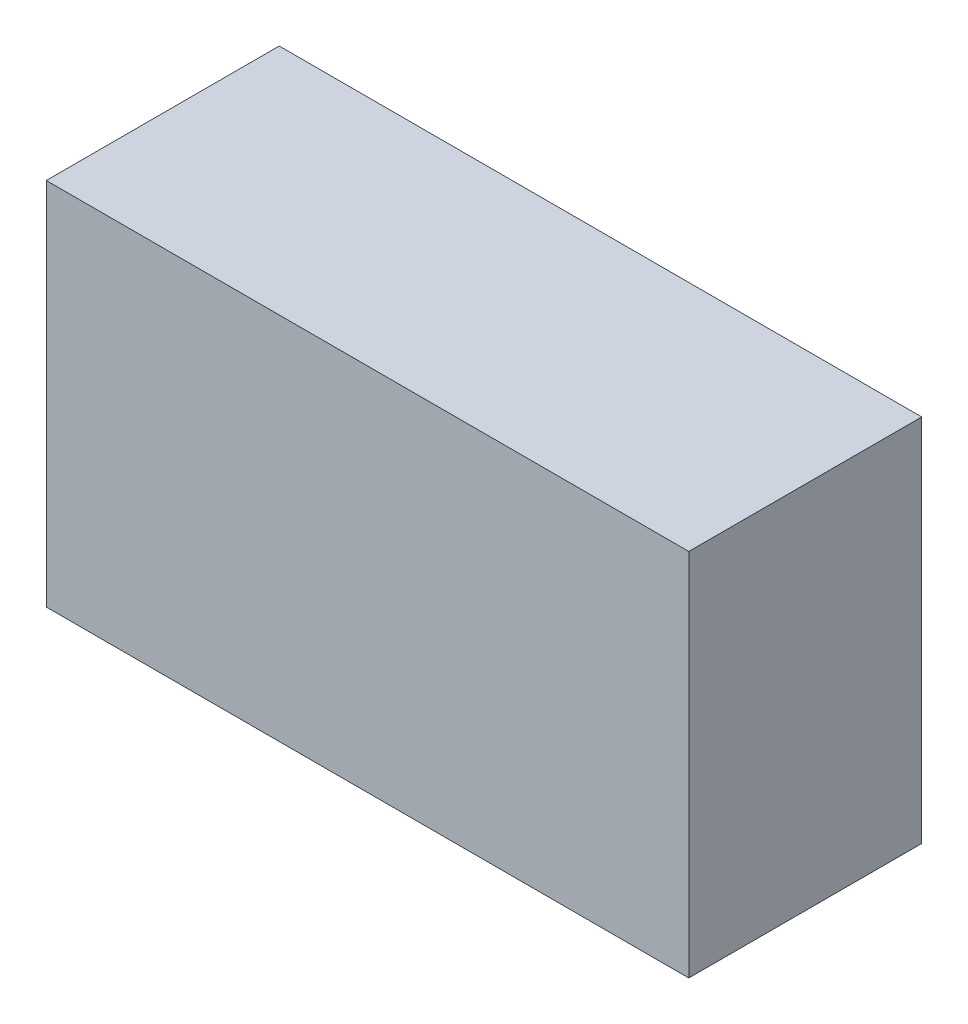
ISO-10303-21;
HEADER;
FILE_DESCRIPTION(('STEP AP214'),'2;1');
FILE_NAME('part.step','',(''),(''),'','','');
FILE_SCHEMA(('AUTOMOTIVE_DESIGN { 1 0 10303 214 1 1 1 1 }'));
ENDSEC;
DATA;
#1=APPLICATION_CONTEXT('core data for automotive mechanical design processes');
#2=APPLICATION_PROTOCOL_DEFINITION('international standard','automotive_design',2000,#1);
#3=PRODUCT_CONTEXT('',#1,'mechanical');
#4=PRODUCT('Part','Part','',(#3));
#5=PRODUCT_RELATED_PRODUCT_CATEGORY('part','',(#4));
#6=PRODUCT_DEFINITION_FORMATION('','',#4);
#7=PRODUCT_DEFINITION_CONTEXT('part definition',#1,'design');
#8=PRODUCT_DEFINITION('design','',#6,#7);
#9=PRODUCT_DEFINITION_SHAPE('','',#8);
#10=(LENGTH_UNIT() NAMED_UNIT(*) SI_UNIT(.MILLI.,.METRE.));
#11=(NAMED_UNIT(*) PLANE_ANGLE_UNIT() SI_UNIT($,.RADIAN.));
#12=(NAMED_UNIT(*) SI_UNIT($,.STERADIAN.) SOLID_ANGLE_UNIT());
#13=UNCERTAINTY_MEASURE_WITH_UNIT(LENGTH_MEASURE(1.E-05),#10,'distance_accuracy_value','');
#14=(GEOMETRIC_REPRESENTATION_CONTEXT(3) GLOBAL_UNCERTAINTY_ASSIGNED_CONTEXT((#13)) GLOBAL_UNIT_ASSIGNED_CONTEXT((#10,
#11,#12)) REPRESENTATION_CONTEXT('',''));
#15=CARTESIAN_POINT('',(0.,0.,0.));
#16=DIRECTION('',(0.,0.,1.));
#17=DIRECTION('',(1.,0.,0.));
#18=AXIS2_PLACEMENT_3D('',#15,#16,#17);
#19=CARTESIAN_POINT('',(3.99949162,-2.29949248,2.89999928));
#20=DIRECTION('',(0.,0.,-1.));
#21=DIRECTION('',(0.,-1.,0.));
#22=AXIS2_PLACEMENT_3D('',#19,#20,#21);
#23=PLANE('',#22);
#24=DIRECTION('',(0.,1.,0.));
#25=VECTOR('',#24,1.);
#26=CARTESIAN_POINT('',(3.99949162,-2.29949248,2.89999928));
#27=LINE('',#26,#25);
#28=CARTESIAN_POINT('',(3.99949162,-2.29949248,2.89999928));
#29=VERTEX_POINT('',#28);
#30=CARTESIAN_POINT('',(3.99949162,2.29949248,2.89999928));
#31=VERTEX_POINT('',#30);
#32=EDGE_CURVE('E82',#29,#31,#27,.T.);
#33=ORIENTED_EDGE('',*,*,#32,.T.);
#34=DIRECTION('',(-1.,0.,0.));
#35=VECTOR('',#34,1.);
#36=CARTESIAN_POINT('',(3.99949162,2.29949248,2.89999928));
#37=LINE('',#36,#35);
#38=CARTESIAN_POINT('',(-3.99949162,2.29949248,2.89999928));
#39=VERTEX_POINT('',#38);
#40=EDGE_CURVE('E80',#31,#39,#37,.T.);
#41=ORIENTED_EDGE('',*,*,#40,.T.);
#42=DIRECTION('',(0.,-1.,0.));
#43=VECTOR('',#42,1.);
#44=CARTESIAN_POINT('',(-3.99949162,2.29949248,2.89999928));
#45=LINE('',#44,#43);
#46=CARTESIAN_POINT('',(-3.99949162,-2.29949248,2.89999928));
#47=VERTEX_POINT('',#46);
#48=EDGE_CURVE('E69',#39,#47,#45,.T.);
#49=ORIENTED_EDGE('',*,*,#48,.T.);
#50=DIRECTION('',(1.,0.,0.));
#51=VECTOR('',#50,1.);
#52=CARTESIAN_POINT('',(-3.99949162,-2.29949248,2.89999928));
#53=LINE('',#52,#51);
#54=EDGE_CURVE('E11',#47,#29,#53,.T.);
#55=ORIENTED_EDGE('',*,*,#54,.T.);
#56=EDGE_LOOP('',(#33,#41,#49,#55));
#57=FACE_BOUND('',#56,.T.);
#58=ADVANCED_FACE('F17',(#57),#23,.F.);
#59=CARTESIAN_POINT('',(3.99949162,-2.29949248,0.));
#60=DIRECTION('',(0.,0.,-1.));
#61=DIRECTION('',(0.,-1.,0.));
#62=AXIS2_PLACEMENT_3D('',#59,#60,#61);
#63=PLANE('',#62);
#64=DIRECTION('',(1.,0.,0.));
#65=VECTOR('',#64,1.);
#66=CARTESIAN_POINT('',(-3.99949162,-2.29949248,0.));
#67=LINE('',#66,#65);
#68=CARTESIAN_POINT('',(-3.99949162,-2.29949248,0.));
#69=VERTEX_POINT('',#68);
#70=CARTESIAN_POINT('',(3.99949162,-2.29949248,0.));
#71=VERTEX_POINT('',#70);
#72=EDGE_CURVE('E20',#69,#71,#67,.T.);
#73=ORIENTED_EDGE('',*,*,#72,.F.);
#74=DIRECTION('',(0.,-1.,0.));
#75=VECTOR('',#74,1.);
#76=CARTESIAN_POINT('',(-3.99949162,2.29949248,0.));
#77=LINE('',#76,#75);
#78=CARTESIAN_POINT('',(-3.99949162,2.29949248,0.));
#79=VERTEX_POINT('',#78);
#80=EDGE_CURVE('E62',#79,#69,#77,.T.);
#81=ORIENTED_EDGE('',*,*,#80,.F.);
#82=DIRECTION('',(-1.,0.,0.));
#83=VECTOR('',#82,1.);
#84=CARTESIAN_POINT('',(3.99949162,2.29949248,0.));
#85=LINE('',#84,#83);
#86=CARTESIAN_POINT('',(3.99949162,2.29949248,0.));
#87=VERTEX_POINT('',#86);
#88=EDGE_CURVE('E89',#87,#79,#85,.T.);
#89=ORIENTED_EDGE('',*,*,#88,.F.);
#90=DIRECTION('',(0.,1.,0.));
#91=VECTOR('',#90,1.);
#92=CARTESIAN_POINT('',(3.99949162,-2.29949248,0.));
#93=LINE('',#92,#91);
#94=EDGE_CURVE('E201',#71,#87,#93,.T.);
#95=ORIENTED_EDGE('',*,*,#94,.F.);
#96=EDGE_LOOP('',(#73,#81,#89,#95));
#97=FACE_BOUND('',#96,.T.);
#98=ADVANCED_FACE('F167',(#97),#63,.T.);
#99=CARTESIAN_POINT('',(-3.99949162,-2.29949248,0.));
#100=DIRECTION('',(0.,1.,0.));
#101=DIRECTION('',(1.,0.,0.));
#102=AXIS2_PLACEMENT_3D('',#99,#100,#101);
#103=PLANE('',#102);
#104=ORIENTED_EDGE('',*,*,#72,.T.);
#105=DIRECTION('',(0.,0.,1.));
#106=VECTOR('',#105,1.);
#107=CARTESIAN_POINT('',(3.99949162,-2.29949248,0.));
#108=LINE('',#107,#106);
#109=EDGE_CURVE('E96',#71,#29,#108,.T.);
#110=ORIENTED_EDGE('',*,*,#109,.T.);
#111=ORIENTED_EDGE('',*,*,#54,.F.);
#112=DIRECTION('',(0.,0.,1.));
#113=VECTOR('',#112,1.);
#114=CARTESIAN_POINT('',(-3.99949162,-2.29949248,0.));
#115=LINE('',#114,#113);
#116=EDGE_CURVE('E75',#69,#47,#115,.T.);
#117=ORIENTED_EDGE('',*,*,#116,.F.);
#118=EDGE_LOOP('',(#104,#110,#111,#117));
#119=FACE_BOUND('',#118,.T.);
#120=ADVANCED_FACE('F158',(#119),#103,.F.);
#121=CARTESIAN_POINT('',(-3.99949162,2.29949248,0.));
#122=DIRECTION('',(1.,0.,0.));
#123=DIRECTION('',(0.,1.,0.));
#124=AXIS2_PLACEMENT_3D('',#121,#122,#123);
#125=PLANE('',#124);
#126=ORIENTED_EDGE('',*,*,#80,.T.);
#127=ORIENTED_EDGE('',*,*,#116,.T.);
#128=ORIENTED_EDGE('',*,*,#48,.F.);
#129=DIRECTION('',(0.,0.,1.));
#130=VECTOR('',#129,1.);
#131=CARTESIAN_POINT('',(-3.99949162,2.29949248,0.));
#132=LINE('',#131,#130);
#133=EDGE_CURVE('E73',#79,#39,#132,.T.);
#134=ORIENTED_EDGE('',*,*,#133,.F.);
#135=EDGE_LOOP('',(#126,#127,#128,#134));
#136=FACE_BOUND('',#135,.T.);
#137=ADVANCED_FACE('F71',(#136),#125,.F.);
#138=CARTESIAN_POINT('',(3.99949162,2.29949248,0.));
#139=DIRECTION('',(0.,-1.,0.));
#140=DIRECTION('',(0.,0.,-1.));
#141=AXIS2_PLACEMENT_3D('',#138,#139,#140);
#142=PLANE('',#141);
#143=ORIENTED_EDGE('',*,*,#88,.T.);
#144=ORIENTED_EDGE('',*,*,#133,.T.);
#145=ORIENTED_EDGE('',*,*,#40,.F.);
#146=DIRECTION('',(0.,0.,1.));
#147=VECTOR('',#146,1.);
#148=CARTESIAN_POINT('',(3.99949162,2.29949248,0.));
#149=LINE('',#148,#147);
#150=EDGE_CURVE('E204',#87,#31,#149,.T.);
#151=ORIENTED_EDGE('',*,*,#150,.F.);
#152=EDGE_LOOP('',(#143,#144,#145,#151));
#153=FACE_BOUND('',#152,.T.);
#154=ADVANCED_FACE('F88',(#153),#142,.F.);
#155=CARTESIAN_POINT('',(3.99949162,-2.29949248,0.));
#156=DIRECTION('',(-1.,0.,0.));
#157=DIRECTION('',(0.,0.,1.));
#158=AXIS2_PLACEMENT_3D('',#155,#156,#157);
#159=PLANE('',#158);
#160=ORIENTED_EDGE('',*,*,#94,.T.);
#161=ORIENTED_EDGE('',*,*,#150,.T.);
#162=ORIENTED_EDGE('',*,*,#32,.F.);
#163=ORIENTED_EDGE('',*,*,#109,.F.);
#164=EDGE_LOOP('',(#160,#161,#162,#163));
#165=FACE_BOUND('',#164,.T.);
#166=ADVANCED_FACE('F131',(#165),#159,.F.);
#167=CLOSED_SHELL('',(#58,#98,#120,#137,#154,#166));
#168=MANIFOLD_SOLID_BREP('B1',#167);
#169=ADVANCED_BREP_SHAPE_REPRESENTATION('',(#18,#168),#14);
#170=SHAPE_DEFINITION_REPRESENTATION(#9,#169);
ENDSEC;
END-ISO-10303-21;
